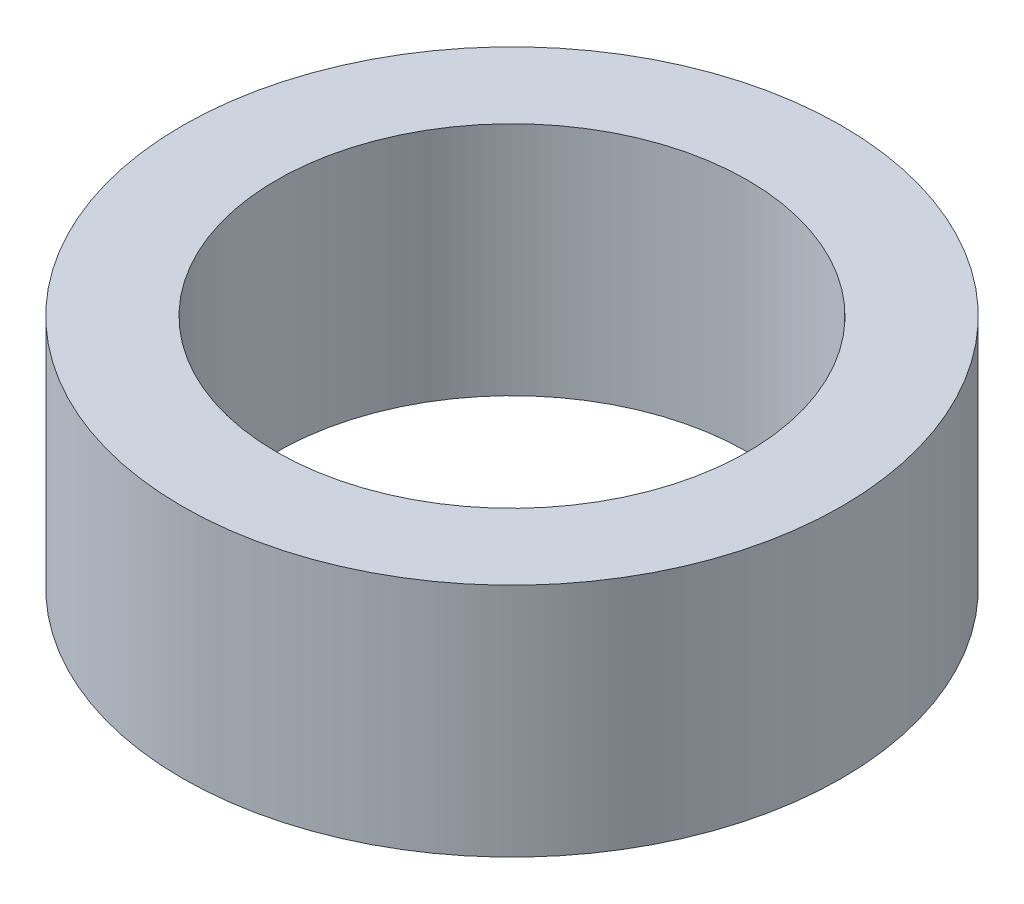
ISO-10303-21;
HEADER;
FILE_DESCRIPTION(('STEP AP214'),'2;1');
FILE_NAME('part.step','',(''),(''),'','','');
FILE_SCHEMA(('AUTOMOTIVE_DESIGN { 1 0 10303 214 1 1 1 1 }'));
ENDSEC;
DATA;
#1=APPLICATION_CONTEXT('core data for automotive mechanical design processes');
#2=APPLICATION_PROTOCOL_DEFINITION('international standard','automotive_design',2000,#1);
#3=PRODUCT_CONTEXT('',#1,'mechanical');
#4=PRODUCT('Part','Part','',(#3));
#5=PRODUCT_RELATED_PRODUCT_CATEGORY('part','',(#4));
#6=PRODUCT_DEFINITION_FORMATION('','',#4);
#7=PRODUCT_DEFINITION_CONTEXT('part definition',#1,'design');
#8=PRODUCT_DEFINITION('design','',#6,#7);
#9=PRODUCT_DEFINITION_SHAPE('','',#8);
#10=(LENGTH_UNIT() NAMED_UNIT(*) SI_UNIT(.MILLI.,.METRE.));
#11=(NAMED_UNIT(*) PLANE_ANGLE_UNIT() SI_UNIT($,.RADIAN.));
#12=(NAMED_UNIT(*) SI_UNIT($,.STERADIAN.) SOLID_ANGLE_UNIT());
#13=UNCERTAINTY_MEASURE_WITH_UNIT(LENGTH_MEASURE(1.E-05),#10,'distance_accuracy_value','');
#14=(GEOMETRIC_REPRESENTATION_CONTEXT(3) GLOBAL_UNCERTAINTY_ASSIGNED_CONTEXT((#13)) GLOBAL_UNIT_ASSIGNED_CONTEXT((#10,
#11,#12)) REPRESENTATION_CONTEXT('',''));
#15=CARTESIAN_POINT('',(0.,0.,0.));
#16=DIRECTION('',(0.,0.,1.));
#17=DIRECTION('',(1.,0.,0.));
#18=AXIS2_PLACEMENT_3D('',#15,#16,#17);
#19=CARTESIAN_POINT('',(0.,25.,0.));
#20=DIRECTION('',(0.,-1.,0.));
#21=DIRECTION('',(0.,0.,-1.));
#22=AXIS2_PLACEMENT_3D('',#19,#20,#21);
#23=CYLINDRICAL_SURFACE('',#22,35.);
#24=CARTESIAN_POINT('',(0.,25.,0.));
#25=DIRECTION('',(0.,1.,0.));
#26=DIRECTION('',(0.,0.,1.));
#27=AXIS2_PLACEMENT_3D('',#24,#25,#26);
#28=CIRCLE('',#27,35.);
#29=CARTESIAN_POINT('',(0.,25.,35.));
#30=VERTEX_POINT('',#29);
#31=EDGE_CURVE('E10',#30,#30,#28,.T.);
#32=ORIENTED_EDGE('',*,*,#31,.F.);
#33=EDGE_LOOP('',(#32));
#34=FACE_BOUND('',#33,.T.);
#35=CARTESIAN_POINT('',(0.,0.,0.));
#36=DIRECTION('',(0.,1.,0.));
#37=DIRECTION('',(0.,0.,1.));
#38=AXIS2_PLACEMENT_3D('',#35,#36,#37);
#39=CIRCLE('',#38,35.);
#40=CARTESIAN_POINT('',(0.,0.,35.));
#41=VERTEX_POINT('',#40);
#42=EDGE_CURVE('E37',#41,#41,#39,.T.);
#43=ORIENTED_EDGE('',*,*,#42,.T.);
#44=EDGE_LOOP('',(#43));
#45=FACE_BOUND('',#44,.T.);
#46=ADVANCED_FACE('F40',(#34,#45),#23,.T.);
#47=CARTESIAN_POINT('',(0.,25.,0.));
#48=DIRECTION('',(0.,1.,0.));
#49=DIRECTION('',(0.,0.,1.));
#50=AXIS2_PLACEMENT_3D('',#47,#48,#49);
#51=PLANE('',#50);
#52=CARTESIAN_POINT('',(0.,25.,0.));
#53=DIRECTION('',(0.,1.,0.));
#54=DIRECTION('',(0.,0.,1.));
#55=AXIS2_PLACEMENT_3D('',#52,#53,#54);
#56=CIRCLE('',#55,25.);
#57=CARTESIAN_POINT('',(0.,25.,25.));
#58=VERTEX_POINT('',#57);
#59=EDGE_CURVE('E50',#58,#58,#56,.T.);
#60=ORIENTED_EDGE('',*,*,#59,.F.);
#61=EDGE_LOOP('',(#60));
#62=FACE_BOUND('',#61,.T.);
#63=ORIENTED_EDGE('',*,*,#31,.T.);
#64=EDGE_LOOP('',(#63));
#65=FACE_BOUND('',#64,.T.);
#66=ADVANCED_FACE('F59',(#62,#65),#51,.T.);
#67=CARTESIAN_POINT('',(0.,0.,0.));
#68=DIRECTION('',(0.,1.,0.));
#69=DIRECTION('',(0.,0.,1.));
#70=AXIS2_PLACEMENT_3D('',#67,#68,#69);
#71=PLANE('',#70);
#72=CARTESIAN_POINT('',(0.,0.,0.));
#73=DIRECTION('',(0.,1.,0.));
#74=DIRECTION('',(0.,0.,1.));
#75=AXIS2_PLACEMENT_3D('',#72,#73,#74);
#76=CIRCLE('',#75,25.);
#77=CARTESIAN_POINT('',(0.,0.,25.));
#78=VERTEX_POINT('',#77);
#79=EDGE_CURVE('E47',#78,#78,#76,.T.);
#80=ORIENTED_EDGE('',*,*,#79,.T.);
#81=EDGE_LOOP('',(#80));
#82=FACE_BOUND('',#81,.T.);
#83=ORIENTED_EDGE('',*,*,#42,.F.);
#84=EDGE_LOOP('',(#83));
#85=FACE_BOUND('',#84,.T.);
#86=ADVANCED_FACE('F58',(#82,#85),#71,.F.);
#87=CARTESIAN_POINT('',(0.,25.,0.));
#88=DIRECTION('',(0.,-1.,0.));
#89=DIRECTION('',(0.,0.,-1.));
#90=AXIS2_PLACEMENT_3D('',#87,#88,#89);
#91=CYLINDRICAL_SURFACE('',#90,25.);
#92=ORIENTED_EDGE('',*,*,#59,.T.);
#93=EDGE_LOOP('',(#92));
#94=FACE_BOUND('',#93,.T.);
#95=ORIENTED_EDGE('',*,*,#79,.F.);
#96=EDGE_LOOP('',(#95));
#97=FACE_BOUND('',#96,.T.);
#98=ADVANCED_FACE('F54',(#94,#97),#91,.F.);
#99=CLOSED_SHELL('',(#46,#66,#86,#98));
#100=MANIFOLD_SOLID_BREP('B2',#99);
#101=ADVANCED_BREP_SHAPE_REPRESENTATION('',(#18,#100),#14);
#102=SHAPE_DEFINITION_REPRESENTATION(#9,#101);
ENDSEC;
END-ISO-10303-21;
